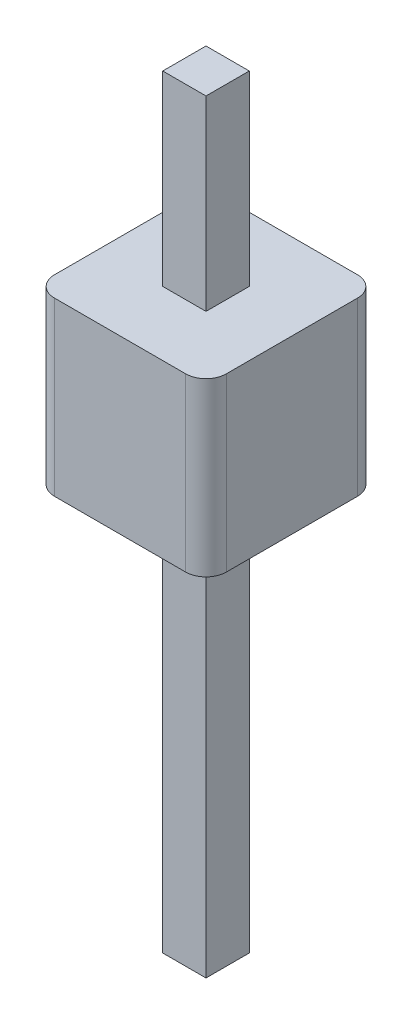
ISO-10303-21;
HEADER;
FILE_DESCRIPTION(('STEP AP214'),'2;1');
FILE_NAME('part.step','',(''),(''),'','','');
FILE_SCHEMA(('AUTOMOTIVE_DESIGN { 1 0 10303 214 1 1 1 1 }'));
ENDSEC;
DATA;
#1=APPLICATION_CONTEXT('core data for automotive mechanical design processes');
#2=APPLICATION_PROTOCOL_DEFINITION('international standard','automotive_design',2000,#1);
#3=PRODUCT_CONTEXT('',#1,'mechanical');
#4=PRODUCT('Part','Part','',(#3));
#5=PRODUCT_RELATED_PRODUCT_CATEGORY('part','',(#4));
#6=PRODUCT_DEFINITION_FORMATION('','',#4);
#7=PRODUCT_DEFINITION_CONTEXT('part definition',#1,'design');
#8=PRODUCT_DEFINITION('design','',#6,#7);
#9=PRODUCT_DEFINITION_SHAPE('','',#8);
#10=(LENGTH_UNIT() NAMED_UNIT(*) SI_UNIT(.MILLI.,.METRE.));
#11=(NAMED_UNIT(*) PLANE_ANGLE_UNIT() SI_UNIT($,.RADIAN.));
#12=(NAMED_UNIT(*) SI_UNIT($,.STERADIAN.) SOLID_ANGLE_UNIT());
#13=UNCERTAINTY_MEASURE_WITH_UNIT(LENGTH_MEASURE(1.E-05),#10,'distance_accuracy_value','');
#14=(GEOMETRIC_REPRESENTATION_CONTEXT(3) GLOBAL_UNCERTAINTY_ASSIGNED_CONTEXT((#13)) GLOBAL_UNIT_ASSIGNED_CONTEXT((#10,
#11,#12)) REPRESENTATION_CONTEXT('',''));
#15=CARTESIAN_POINT('',(0.,0.,0.));
#16=DIRECTION('',(0.,0.,1.));
#17=DIRECTION('',(1.,0.,0.));
#18=AXIS2_PLACEMENT_3D('',#15,#16,#17);
#19=CARTESIAN_POINT('',(-0.97,2.54,0.97));
#20=DIRECTION('',(0.,-1.,0.));
#21=DIRECTION('',(0.,0.,-1.));
#22=AXIS2_PLACEMENT_3D('',#19,#20,#21);
#23=PLANE('',#22);
#24=CARTESIAN_POINT('',(-0.97,2.54,0.97));
#25=DIRECTION('',(0.,1.,0.));
#26=DIRECTION('',(0.,0.,-1.));
#27=AXIS2_PLACEMENT_3D('',#24,#25,#26);
#28=CIRCLE('',#27,0.3);
#29=CARTESIAN_POINT('',(-1.27,2.54,0.97));
#30=VERTEX_POINT('',#29);
#31=CARTESIAN_POINT('',(-0.97,2.54,1.27));
#32=VERTEX_POINT('',#31);
#33=EDGE_CURVE('E243',#30,#32,#28,.T.);
#34=ORIENTED_EDGE('',*,*,#33,.T.);
#35=DIRECTION('',(1.,0.,0.));
#36=VECTOR('',#35,1.);
#37=CARTESIAN_POINT('',(0.970000000000001,2.54,1.27));
#38=LINE('',#37,#36);
#39=CARTESIAN_POINT('',(0.970000000000001,2.54,1.27));
#40=VERTEX_POINT('',#39);
#41=EDGE_CURVE('E247',#32,#40,#38,.T.);
#42=ORIENTED_EDGE('',*,*,#41,.T.);
#43=CARTESIAN_POINT('',(0.97,2.54,0.97));
#44=DIRECTION('',(0.,1.,0.));
#45=DIRECTION('',(0.,0.,1.));
#46=AXIS2_PLACEMENT_3D('',#43,#44,#45);
#47=CIRCLE('',#46,0.3);
#48=CARTESIAN_POINT('',(1.27,2.54,0.97));
#49=VERTEX_POINT('',#48);
#50=EDGE_CURVE('E251',#40,#49,#47,.T.);
#51=ORIENTED_EDGE('',*,*,#50,.T.);
#52=DIRECTION('',(0.,0.,-1.));
#53=VECTOR('',#52,1.);
#54=CARTESIAN_POINT('',(1.27,2.54,0.97));
#55=LINE('',#54,#53);
#56=CARTESIAN_POINT('',(1.27,2.54,-0.97));
#57=VERTEX_POINT('',#56);
#58=EDGE_CURVE('E254',#49,#57,#55,.T.);
#59=ORIENTED_EDGE('',*,*,#58,.T.);
#60=CARTESIAN_POINT('',(0.97,2.54,-0.97));
#61=DIRECTION('',(0.,1.,0.));
#62=DIRECTION('',(0.,0.,1.));
#63=AXIS2_PLACEMENT_3D('',#60,#61,#62);
#64=CIRCLE('',#63,0.3);
#65=CARTESIAN_POINT('',(0.97,2.54,-1.27));
#66=VERTEX_POINT('',#65);
#67=EDGE_CURVE('E257',#57,#66,#64,.T.);
#68=ORIENTED_EDGE('',*,*,#67,.T.);
#69=DIRECTION('',(-1.,0.,0.));
#70=VECTOR('',#69,1.);
#71=CARTESIAN_POINT('',(0.97,2.54,-1.27));
#72=LINE('',#71,#70);
#73=CARTESIAN_POINT('',(-0.969999999999998,2.54,-1.27));
#74=VERTEX_POINT('',#73);
#75=EDGE_CURVE('E260',#66,#74,#72,.T.);
#76=ORIENTED_EDGE('',*,*,#75,.T.);
#77=CARTESIAN_POINT('',(-0.97,2.54,-0.97));
#78=DIRECTION('',(0.,1.,0.));
#79=DIRECTION('',(0.,0.,1.));
#80=AXIS2_PLACEMENT_3D('',#77,#78,#79);
#81=CIRCLE('',#80,0.3);
#82=CARTESIAN_POINT('',(-1.27,2.54,-0.969999999999998));
#83=VERTEX_POINT('',#82);
#84=EDGE_CURVE('E263',#74,#83,#81,.T.);
#85=ORIENTED_EDGE('',*,*,#84,.T.);
#86=DIRECTION('',(0.,0.,1.));
#87=VECTOR('',#86,1.);
#88=CARTESIAN_POINT('',(-1.27,2.54,0.97));
#89=LINE('',#88,#87);
#90=EDGE_CURVE('E266',#83,#30,#89,.T.);
#91=ORIENTED_EDGE('',*,*,#90,.T.);
#92=EDGE_LOOP('',(#34,#42,#51,#59,#68,#76,#85,#91));
#93=FACE_BOUND('',#92,.T.);
#94=DIRECTION('',(0.,0.,1.));
#95=VECTOR('',#94,1.);
#96=CARTESIAN_POINT('',(-0.32,2.54,0.32));
#97=LINE('',#96,#95);
#98=CARTESIAN_POINT('',(-0.32,2.54,-0.32));
#99=VERTEX_POINT('',#98);
#100=CARTESIAN_POINT('',(-0.32,2.54,0.32));
#101=VERTEX_POINT('',#100);
#102=EDGE_CURVE('E215',#99,#101,#97,.T.);
#103=ORIENTED_EDGE('',*,*,#102,.F.);
#104=DIRECTION('',(-1.,0.,0.));
#105=VECTOR('',#104,1.);
#106=CARTESIAN_POINT('',(0.32,2.54,-0.32));
#107=LINE('',#106,#105);
#108=CARTESIAN_POINT('',(0.32,2.54,-0.32));
#109=VERTEX_POINT('',#108);
#110=EDGE_CURVE('E55',#109,#99,#107,.T.);
#111=ORIENTED_EDGE('',*,*,#110,.F.);
#112=DIRECTION('',(0.,0.,-1.));
#113=VECTOR('',#112,1.);
#114=CARTESIAN_POINT('',(0.32,2.54,0.32));
#115=LINE('',#114,#113);
#116=CARTESIAN_POINT('',(0.32,2.54,0.32));
#117=VERTEX_POINT('',#116);
#118=EDGE_CURVE('E161',#117,#109,#115,.T.);
#119=ORIENTED_EDGE('',*,*,#118,.F.);
#120=DIRECTION('',(1.,0.,0.));
#121=VECTOR('',#120,1.);
#122=CARTESIAN_POINT('',(0.32,2.54,0.32));
#123=LINE('',#122,#121);
#124=EDGE_CURVE('E219',#101,#117,#123,.T.);
#125=ORIENTED_EDGE('',*,*,#124,.F.);
#126=EDGE_LOOP('',(#103,#111,#119,#125));
#127=FACE_BOUND('',#126,.T.);
#128=ADVANCED_FACE('F39',(#93,#127),#23,.F.);
#129=CARTESIAN_POINT('',(-0.97,0.,0.97));
#130=DIRECTION('',(0.,-1.,0.));
#131=DIRECTION('',(0.,0.,-1.));
#132=AXIS2_PLACEMENT_3D('',#129,#130,#131);
#133=PLANE('',#132);
#134=CARTESIAN_POINT('',(-0.97,0.,0.97));
#135=DIRECTION('',(0.,1.,0.));
#136=DIRECTION('',(0.,0.,-1.));
#137=AXIS2_PLACEMENT_3D('',#134,#135,#136);
#138=CIRCLE('',#137,0.3);
#139=CARTESIAN_POINT('',(-1.27,0.,0.97));
#140=VERTEX_POINT('',#139);
#141=CARTESIAN_POINT('',(-0.97,0.,1.27));
#142=VERTEX_POINT('',#141);
#143=EDGE_CURVE('E228',#140,#142,#138,.T.);
#144=ORIENTED_EDGE('',*,*,#143,.F.);
#145=DIRECTION('',(0.,0.,1.));
#146=VECTOR('',#145,1.);
#147=CARTESIAN_POINT('',(-1.27,0.,0.97));
#148=LINE('',#147,#146);
#149=CARTESIAN_POINT('',(-1.27,0.,-0.969999999999998));
#150=VERTEX_POINT('',#149);
#151=EDGE_CURVE('E248',#150,#140,#148,.T.);
#152=ORIENTED_EDGE('',*,*,#151,.F.);
#153=CARTESIAN_POINT('',(-0.97,0.,-0.97));
#154=DIRECTION('',(0.,1.,0.));
#155=DIRECTION('',(0.,0.,1.));
#156=AXIS2_PLACEMENT_3D('',#153,#154,#155);
#157=CIRCLE('',#156,0.3);
#158=CARTESIAN_POINT('',(-0.969999999999998,0.,-1.27));
#159=VERTEX_POINT('',#158);
#160=EDGE_CURVE('E288',#159,#150,#157,.T.);
#161=ORIENTED_EDGE('',*,*,#160,.F.);
#162=DIRECTION('',(-1.,0.,0.));
#163=VECTOR('',#162,1.);
#164=CARTESIAN_POINT('',(0.97,0.,-1.27));
#165=LINE('',#164,#163);
#166=CARTESIAN_POINT('',(0.97,0.,-1.27));
#167=VERTEX_POINT('',#166);
#168=EDGE_CURVE('E285',#167,#159,#165,.T.);
#169=ORIENTED_EDGE('',*,*,#168,.F.);
#170=CARTESIAN_POINT('',(0.97,0.,-0.97));
#171=DIRECTION('',(0.,1.,0.));
#172=DIRECTION('',(0.,0.,1.));
#173=AXIS2_PLACEMENT_3D('',#170,#171,#172);
#174=CIRCLE('',#173,0.3);
#175=CARTESIAN_POINT('',(1.27,0.,-0.97));
#176=VERTEX_POINT('',#175);
#177=EDGE_CURVE('E282',#176,#167,#174,.T.);
#178=ORIENTED_EDGE('',*,*,#177,.F.);
#179=DIRECTION('',(0.,0.,-1.));
#180=VECTOR('',#179,1.);
#181=CARTESIAN_POINT('',(1.27,0.,0.97));
#182=LINE('',#181,#180);
#183=CARTESIAN_POINT('',(1.27,0.,0.97));
#184=VERTEX_POINT('',#183);
#185=EDGE_CURVE('E279',#184,#176,#182,.T.);
#186=ORIENTED_EDGE('',*,*,#185,.F.);
#187=CARTESIAN_POINT('',(0.97,0.,0.97));
#188=DIRECTION('',(0.,1.,0.));
#189=DIRECTION('',(0.,0.,1.));
#190=AXIS2_PLACEMENT_3D('',#187,#188,#189);
#191=CIRCLE('',#190,0.3);
#192=CARTESIAN_POINT('',(0.970000000000001,0.,1.27));
#193=VERTEX_POINT('',#192);
#194=EDGE_CURVE('E276',#193,#184,#191,.T.);
#195=ORIENTED_EDGE('',*,*,#194,.F.);
#196=DIRECTION('',(1.,0.,0.));
#197=VECTOR('',#196,1.);
#198=CARTESIAN_POINT('',(0.970000000000001,0.,1.27));
#199=LINE('',#198,#197);
#200=EDGE_CURVE('E273',#142,#193,#199,.T.);
#201=ORIENTED_EDGE('',*,*,#200,.F.);
#202=EDGE_LOOP('',(#144,#152,#161,#169,#178,#186,#195,#201));
#203=FACE_BOUND('',#202,.T.);
#204=DIRECTION('',(-1.,0.,0.));
#205=VECTOR('',#204,1.);
#206=CARTESIAN_POINT('',(0.32,0.,-0.32));
#207=LINE('',#206,#205);
#208=CARTESIAN_POINT('',(0.32,0.,-0.32));
#209=VERTEX_POINT('',#208);
#210=CARTESIAN_POINT('',(-0.32,0.,-0.32));
#211=VERTEX_POINT('',#210);
#212=EDGE_CURVE('E220',#209,#211,#207,.T.);
#213=ORIENTED_EDGE('',*,*,#212,.T.);
#214=DIRECTION('',(0.,0.,1.));
#215=VECTOR('',#214,1.);
#216=CARTESIAN_POINT('',(-0.32,0.,0.32));
#217=LINE('',#216,#215);
#218=CARTESIAN_POINT('',(-0.32,0.,0.32));
#219=VERTEX_POINT('',#218);
#220=EDGE_CURVE('E204',#211,#219,#217,.T.);
#221=ORIENTED_EDGE('',*,*,#220,.T.);
#222=DIRECTION('',(1.,0.,0.));
#223=VECTOR('',#222,1.);
#224=CARTESIAN_POINT('',(0.32,0.,0.32));
#225=LINE('',#224,#223);
#226=CARTESIAN_POINT('',(0.32,0.,0.32));
#227=VERTEX_POINT('',#226);
#228=EDGE_CURVE('E232',#219,#227,#225,.T.);
#229=ORIENTED_EDGE('',*,*,#228,.T.);
#230=DIRECTION('',(0.,0.,-1.));
#231=VECTOR('',#230,1.);
#232=CARTESIAN_POINT('',(0.32,0.,0.32));
#233=LINE('',#232,#231);
#234=EDGE_CURVE('E236',#227,#209,#233,.T.);
#235=ORIENTED_EDGE('',*,*,#234,.T.);
#236=EDGE_LOOP('',(#213,#221,#229,#235));
#237=FACE_BOUND('',#236,.T.);
#238=ADVANCED_FACE('F327',(#203,#237),#133,.T.);
#239=CARTESIAN_POINT('',(-0.97,2.54,0.97));
#240=DIRECTION('',(0.,-1.,0.));
#241=DIRECTION('',(0.,0.,-1.));
#242=AXIS2_PLACEMENT_3D('',#239,#240,#241);
#243=CYLINDRICAL_SURFACE('',#242,0.3);
#244=ORIENTED_EDGE('',*,*,#143,.T.);
#245=DIRECTION('',(0.,-1.,0.));
#246=VECTOR('',#245,1.);
#247=CARTESIAN_POINT('',(-0.97,2.54,1.27));
#248=LINE('',#247,#246);
#249=EDGE_CURVE('E11',#32,#142,#248,.T.);
#250=ORIENTED_EDGE('',*,*,#249,.F.);
#251=ORIENTED_EDGE('',*,*,#33,.F.);
#252=DIRECTION('',(0.,-1.,0.));
#253=VECTOR('',#252,1.);
#254=CARTESIAN_POINT('',(-1.27,2.54,0.97));
#255=LINE('',#254,#253);
#256=EDGE_CURVE('E269',#30,#140,#255,.T.);
#257=ORIENTED_EDGE('',*,*,#256,.T.);
#258=EDGE_LOOP('',(#244,#250,#251,#257));
#259=FACE_BOUND('',#258,.T.);
#260=ADVANCED_FACE('F41',(#259),#243,.T.);
#261=CARTESIAN_POINT('',(0.970000000000001,2.54,1.27));
#262=DIRECTION('',(0.,0.,-1.));
#263=DIRECTION('',(-1.,0.,0.));
#264=AXIS2_PLACEMENT_3D('',#261,#262,#263);
#265=PLANE('',#264);
#266=ORIENTED_EDGE('',*,*,#200,.T.);
#267=DIRECTION('',(0.,-1.,0.));
#268=VECTOR('',#267,1.);
#269=CARTESIAN_POINT('',(0.970000000000001,2.54,1.27));
#270=LINE('',#269,#268);
#271=EDGE_CURVE('E48',#40,#193,#270,.T.);
#272=ORIENTED_EDGE('',*,*,#271,.F.);
#273=ORIENTED_EDGE('',*,*,#41,.F.);
#274=ORIENTED_EDGE('',*,*,#249,.T.);
#275=EDGE_LOOP('',(#266,#272,#273,#274));
#276=FACE_BOUND('',#275,.T.);
#277=ADVANCED_FACE('F344',(#276),#265,.F.);
#278=CARTESIAN_POINT('',(0.97,2.54,0.97));
#279=DIRECTION('',(0.,-1.,0.));
#280=DIRECTION('',(0.,0.,-1.));
#281=AXIS2_PLACEMENT_3D('',#278,#279,#280);
#282=CYLINDRICAL_SURFACE('',#281,0.3);
#283=ORIENTED_EDGE('',*,*,#194,.T.);
#284=DIRECTION('',(0.,-1.,0.));
#285=VECTOR('',#284,1.);
#286=CARTESIAN_POINT('',(1.27,2.54,0.97));
#287=LINE('',#286,#285);
#288=EDGE_CURVE('E312',#49,#184,#287,.T.);
#289=ORIENTED_EDGE('',*,*,#288,.F.);
#290=ORIENTED_EDGE('',*,*,#50,.F.);
#291=ORIENTED_EDGE('',*,*,#271,.T.);
#292=EDGE_LOOP('',(#283,#289,#290,#291));
#293=FACE_BOUND('',#292,.T.);
#294=ADVANCED_FACE('F321',(#293),#282,.T.);
#295=CARTESIAN_POINT('',(1.27,2.54,0.97));
#296=DIRECTION('',(-1.,0.,0.));
#297=DIRECTION('',(0.,0.,1.));
#298=AXIS2_PLACEMENT_3D('',#295,#296,#297);
#299=PLANE('',#298);
#300=ORIENTED_EDGE('',*,*,#185,.T.);
#301=DIRECTION('',(0.,-1.,0.));
#302=VECTOR('',#301,1.);
#303=CARTESIAN_POINT('',(1.27,2.54,-0.97));
#304=LINE('',#303,#302);
#305=EDGE_CURVE('E308',#57,#176,#304,.T.);
#306=ORIENTED_EDGE('',*,*,#305,.F.);
#307=ORIENTED_EDGE('',*,*,#58,.F.);
#308=ORIENTED_EDGE('',*,*,#288,.T.);
#309=EDGE_LOOP('',(#300,#306,#307,#308));
#310=FACE_BOUND('',#309,.T.);
#311=ADVANCED_FACE('F333',(#310),#299,.F.);
#312=CARTESIAN_POINT('',(0.97,2.54,-0.97));
#313=DIRECTION('',(0.,-1.,0.));
#314=DIRECTION('',(0.,0.,-1.));
#315=AXIS2_PLACEMENT_3D('',#312,#313,#314);
#316=CYLINDRICAL_SURFACE('',#315,0.3);
#317=ORIENTED_EDGE('',*,*,#177,.T.);
#318=DIRECTION('',(0.,-1.,0.));
#319=VECTOR('',#318,1.);
#320=CARTESIAN_POINT('',(0.97,2.54,-1.27));
#321=LINE('',#320,#319);
#322=EDGE_CURVE('E304',#66,#167,#321,.T.);
#323=ORIENTED_EDGE('',*,*,#322,.F.);
#324=ORIENTED_EDGE('',*,*,#67,.F.);
#325=ORIENTED_EDGE('',*,*,#305,.T.);
#326=EDGE_LOOP('',(#317,#323,#324,#325));
#327=FACE_BOUND('',#326,.T.);
#328=ADVANCED_FACE('F337',(#327),#316,.T.);
#329=CARTESIAN_POINT('',(0.97,2.54,-1.27));
#330=DIRECTION('',(0.,0.,1.));
#331=DIRECTION('',(1.,0.,0.));
#332=AXIS2_PLACEMENT_3D('',#329,#330,#331);
#333=PLANE('',#332);
#334=ORIENTED_EDGE('',*,*,#168,.T.);
#335=DIRECTION('',(0.,-1.,0.));
#336=VECTOR('',#335,1.);
#337=CARTESIAN_POINT('',(-0.969999999999998,2.54,-1.27));
#338=LINE('',#337,#336);
#339=EDGE_CURVE('E300',#74,#159,#338,.T.);
#340=ORIENTED_EDGE('',*,*,#339,.F.);
#341=ORIENTED_EDGE('',*,*,#75,.F.);
#342=ORIENTED_EDGE('',*,*,#322,.T.);
#343=EDGE_LOOP('',(#334,#340,#341,#342));
#344=FACE_BOUND('',#343,.T.);
#345=ADVANCED_FACE('F357',(#344),#333,.F.);
#346=CARTESIAN_POINT('',(-0.97,2.54,-0.97));
#347=DIRECTION('',(0.,-1.,0.));
#348=DIRECTION('',(0.,0.,-1.));
#349=AXIS2_PLACEMENT_3D('',#346,#347,#348);
#350=CYLINDRICAL_SURFACE('',#349,0.3);
#351=ORIENTED_EDGE('',*,*,#160,.T.);
#352=DIRECTION('',(0.,-1.,0.));
#353=VECTOR('',#352,1.);
#354=CARTESIAN_POINT('',(-1.27,2.54,-0.969999999999998));
#355=LINE('',#354,#353);
#356=EDGE_CURVE('E296',#83,#150,#355,.T.);
#357=ORIENTED_EDGE('',*,*,#356,.F.);
#358=ORIENTED_EDGE('',*,*,#84,.F.);
#359=ORIENTED_EDGE('',*,*,#339,.T.);
#360=EDGE_LOOP('',(#351,#357,#358,#359));
#361=FACE_BOUND('',#360,.T.);
#362=ADVANCED_FACE('F355',(#361),#350,.T.);
#363=CARTESIAN_POINT('',(-1.27,2.54,0.97));
#364=DIRECTION('',(1.,0.,0.));
#365=DIRECTION('',(0.,0.,-1.));
#366=AXIS2_PLACEMENT_3D('',#363,#364,#365);
#367=PLANE('',#366);
#368=ORIENTED_EDGE('',*,*,#151,.T.);
#369=ORIENTED_EDGE('',*,*,#256,.F.);
#370=ORIENTED_EDGE('',*,*,#90,.F.);
#371=ORIENTED_EDGE('',*,*,#356,.T.);
#372=EDGE_LOOP('',(#368,#369,#370,#371));
#373=FACE_BOUND('',#372,.T.);
#374=ADVANCED_FACE('F350',(#373),#367,.F.);
#375=CARTESIAN_POINT('',(0.,-6.,0.));
#376=DIRECTION('',(0.,1.,0.));
#377=DIRECTION('',(0.,0.,1.));
#378=AXIS2_PLACEMENT_3D('',#375,#376,#377);
#379=PLANE('',#378);
#380=DIRECTION('',(0.,0.,-1.));
#381=VECTOR('',#380,1.);
#382=CARTESIAN_POINT('',(0.32,-6.,0.32));
#383=LINE('',#382,#381);
#384=CARTESIAN_POINT('',(0.32,-6.,0.32));
#385=VERTEX_POINT('',#384);
#386=CARTESIAN_POINT('',(0.32,-6.,-0.32));
#387=VERTEX_POINT('',#386);
#388=EDGE_CURVE('E188',#385,#387,#383,.T.);
#389=ORIENTED_EDGE('',*,*,#388,.F.);
#390=DIRECTION('',(-1.,0.,0.));
#391=VECTOR('',#390,1.);
#392=CARTESIAN_POINT('',(0.32,-6.,0.32));
#393=LINE('',#392,#391);
#394=CARTESIAN_POINT('',(-0.32,-6.,0.32));
#395=VERTEX_POINT('',#394);
#396=EDGE_CURVE('E165',#385,#395,#393,.T.);
#397=ORIENTED_EDGE('',*,*,#396,.T.);
#398=DIRECTION('',(0.,0.,-1.));
#399=VECTOR('',#398,1.);
#400=CARTESIAN_POINT('',(-0.32,-6.,0.32));
#401=LINE('',#400,#399);
#402=CARTESIAN_POINT('',(-0.32,-6.,-0.32));
#403=VERTEX_POINT('',#402);
#404=EDGE_CURVE('E195',#395,#403,#401,.T.);
#405=ORIENTED_EDGE('',*,*,#404,.T.);
#406=DIRECTION('',(-1.,0.,0.));
#407=VECTOR('',#406,1.);
#408=CARTESIAN_POINT('',(0.32,-6.,-0.32));
#409=LINE('',#408,#407);
#410=EDGE_CURVE('E192',#387,#403,#409,.T.);
#411=ORIENTED_EDGE('',*,*,#410,.F.);
#412=EDGE_LOOP('',(#389,#397,#405,#411));
#413=FACE_BOUND('',#412,.T.);
#414=ADVANCED_FACE('F377',(#413),#379,.F.);
#415=CARTESIAN_POINT('',(0.32,-6.,-0.32));
#416=DIRECTION('',(0.,0.,-1.));
#417=DIRECTION('',(-1.,0.,0.));
#418=AXIS2_PLACEMENT_3D('',#415,#416,#417);
#419=PLANE('',#418);
#420=DIRECTION('',(0.,1.,0.));
#421=VECTOR('',#420,1.);
#422=CARTESIAN_POINT('',(-0.32,-6.,-0.32));
#423=LINE('',#422,#421);
#424=EDGE_CURVE('E63',#403,#211,#423,.T.);
#425=ORIENTED_EDGE('',*,*,#424,.T.);
#426=ORIENTED_EDGE('',*,*,#212,.F.);
#427=DIRECTION('',(0.,1.,0.));
#428=VECTOR('',#427,1.);
#429=CARTESIAN_POINT('',(0.32,-6.,-0.32));
#430=LINE('',#429,#428);
#431=EDGE_CURVE('E164',#387,#209,#430,.T.);
#432=ORIENTED_EDGE('',*,*,#431,.F.);
#433=ORIENTED_EDGE('',*,*,#410,.T.);
#434=EDGE_LOOP('',(#425,#426,#432,#433));
#435=FACE_BOUND('',#434,.T.);
#436=ADVANCED_FACE('F381',(#435),#419,.T.);
#437=CARTESIAN_POINT('',(-0.32,-6.,0.32));
#438=DIRECTION('',(1.,0.,0.));
#439=DIRECTION('',(0.,0.,-1.));
#440=AXIS2_PLACEMENT_3D('',#437,#438,#439);
#441=PLANE('',#440);
#442=ORIENTED_EDGE('',*,*,#220,.F.);
#443=ORIENTED_EDGE('',*,*,#424,.F.);
#444=ORIENTED_EDGE('',*,*,#404,.F.);
#445=DIRECTION('',(0.,1.,0.));
#446=VECTOR('',#445,1.);
#447=CARTESIAN_POINT('',(-0.32,-6.,0.32));
#448=LINE('',#447,#446);
#449=EDGE_CURVE('E206',#395,#219,#448,.T.);
#450=ORIENTED_EDGE('',*,*,#449,.T.);
#451=EDGE_LOOP('',(#442,#443,#444,#450));
#452=FACE_BOUND('',#451,.T.);
#453=ADVANCED_FACE('F387',(#452),#441,.F.);
#454=CARTESIAN_POINT('',(0.32,-6.,0.32));
#455=DIRECTION('',(0.,0.,-1.));
#456=DIRECTION('',(-1.,0.,0.));
#457=AXIS2_PLACEMENT_3D('',#454,#455,#456);
#458=PLANE('',#457);
#459=ORIENTED_EDGE('',*,*,#228,.F.);
#460=ORIENTED_EDGE('',*,*,#449,.F.);
#461=ORIENTED_EDGE('',*,*,#396,.F.);
#462=DIRECTION('',(0.,1.,0.));
#463=VECTOR('',#462,1.);
#464=CARTESIAN_POINT('',(0.32,-6.,0.32));
#465=LINE('',#464,#463);
#466=EDGE_CURVE('E200',#385,#227,#465,.T.);
#467=ORIENTED_EDGE('',*,*,#466,.T.);
#468=EDGE_LOOP('',(#459,#460,#461,#467));
#469=FACE_BOUND('',#468,.T.);
#470=ADVANCED_FACE('F391',(#469),#458,.F.);
#471=CARTESIAN_POINT('',(0.32,-6.,0.32));
#472=DIRECTION('',(1.,0.,0.));
#473=DIRECTION('',(0.,0.,-1.));
#474=AXIS2_PLACEMENT_3D('',#471,#472,#473);
#475=PLANE('',#474);
#476=ORIENTED_EDGE('',*,*,#431,.T.);
#477=ORIENTED_EDGE('',*,*,#234,.F.);
#478=ORIENTED_EDGE('',*,*,#466,.F.);
#479=ORIENTED_EDGE('',*,*,#388,.T.);
#480=EDGE_LOOP('',(#476,#477,#478,#479));
#481=FACE_BOUND('',#480,.T.);
#482=ADVANCED_FACE('F373',(#481),#475,.T.);
#483=CARTESIAN_POINT('',(-0.32,5.3,0.32));
#484=VERTEX_POINT('',#483);
#485=EDGE_CURVE('E210',#101,#484,#448,.T.);
#486=ORIENTED_EDGE('',*,*,#485,.F.);
#487=ORIENTED_EDGE('',*,*,#124,.T.);
#488=CARTESIAN_POINT('',(0.32,5.3,0.32));
#489=VERTEX_POINT('',#488);
#490=EDGE_CURVE('E205',#117,#489,#465,.T.);
#491=ORIENTED_EDGE('',*,*,#490,.T.);
#492=DIRECTION('',(-1.,0.,0.));
#493=VECTOR('',#492,1.);
#494=CARTESIAN_POINT('',(0.32,5.3,0.32));
#495=LINE('',#494,#493);
#496=EDGE_CURVE('E180',#489,#484,#495,.T.);
#497=ORIENTED_EDGE('',*,*,#496,.T.);
#498=EDGE_LOOP('',(#486,#487,#491,#497));
#499=FACE_BOUND('',#498,.T.);
#500=ADVANCED_FACE('F395',(#499),#458,.F.);
#501=ORIENTED_EDGE('',*,*,#110,.T.);
#502=CARTESIAN_POINT('',(-0.32,5.3,-0.32));
#503=VERTEX_POINT('',#502);
#504=EDGE_CURVE('E171',#99,#503,#423,.T.);
#505=ORIENTED_EDGE('',*,*,#504,.T.);
#506=DIRECTION('',(-1.,0.,0.));
#507=VECTOR('',#506,1.);
#508=CARTESIAN_POINT('',(0.32,5.3,-0.32));
#509=LINE('',#508,#507);
#510=CARTESIAN_POINT('',(0.32,5.3,-0.32));
#511=VERTEX_POINT('',#510);
#512=EDGE_CURVE('E168',#511,#503,#509,.T.);
#513=ORIENTED_EDGE('',*,*,#512,.F.);
#514=EDGE_CURVE('E154',#109,#511,#430,.T.);
#515=ORIENTED_EDGE('',*,*,#514,.F.);
#516=EDGE_LOOP('',(#501,#505,#513,#515));
#517=FACE_BOUND('',#516,.T.);
#518=ADVANCED_FACE('F169',(#517),#419,.T.);
#519=ORIENTED_EDGE('',*,*,#118,.T.);
#520=ORIENTED_EDGE('',*,*,#514,.T.);
#521=DIRECTION('',(0.,0.,-1.));
#522=VECTOR('',#521,1.);
#523=CARTESIAN_POINT('',(0.32,5.3,0.32));
#524=LINE('',#523,#522);
#525=EDGE_CURVE('E159',#489,#511,#524,.T.);
#526=ORIENTED_EDGE('',*,*,#525,.F.);
#527=ORIENTED_EDGE('',*,*,#490,.F.);
#528=EDGE_LOOP('',(#519,#520,#526,#527));
#529=FACE_BOUND('',#528,.T.);
#530=ADVANCED_FACE('F156',(#529),#475,.T.);
#531=ORIENTED_EDGE('',*,*,#504,.F.);
#532=ORIENTED_EDGE('',*,*,#102,.T.);
#533=ORIENTED_EDGE('',*,*,#485,.T.);
#534=DIRECTION('',(0.,0.,-1.));
#535=VECTOR('',#534,1.);
#536=CARTESIAN_POINT('',(-0.32,5.3,0.32));
#537=LINE('',#536,#535);
#538=EDGE_CURVE('E176',#484,#503,#537,.T.);
#539=ORIENTED_EDGE('',*,*,#538,.T.);
#540=EDGE_LOOP('',(#531,#532,#533,#539));
#541=FACE_BOUND('',#540,.T.);
#542=ADVANCED_FACE('F398',(#541),#441,.F.);
#543=CARTESIAN_POINT('',(0.,5.3,0.));
#544=DIRECTION('',(0.,1.,0.));
#545=DIRECTION('',(0.,0.,1.));
#546=AXIS2_PLACEMENT_3D('',#543,#544,#545);
#547=PLANE('',#546);
#548=ORIENTED_EDGE('',*,*,#525,.T.);
#549=ORIENTED_EDGE('',*,*,#512,.T.);
#550=ORIENTED_EDGE('',*,*,#538,.F.);
#551=ORIENTED_EDGE('',*,*,#496,.F.);
#552=EDGE_LOOP('',(#548,#549,#550,#551));
#553=FACE_BOUND('',#552,.T.);
#554=ADVANCED_FACE('F178',(#553),#547,.T.);
#555=CLOSED_SHELL('',(#128,#238,#260,#277,#294,#311,#328,#345,#362,#374,#414,#436,#453,#470,
#482,#500,#518,#530,#542,#554));
#556=MANIFOLD_SOLID_BREP('B2',#555);
#557=ADVANCED_BREP_SHAPE_REPRESENTATION('',(#18,#556),#14);
#558=SHAPE_DEFINITION_REPRESENTATION(#9,#557);
ENDSEC;
END-ISO-10303-21;
